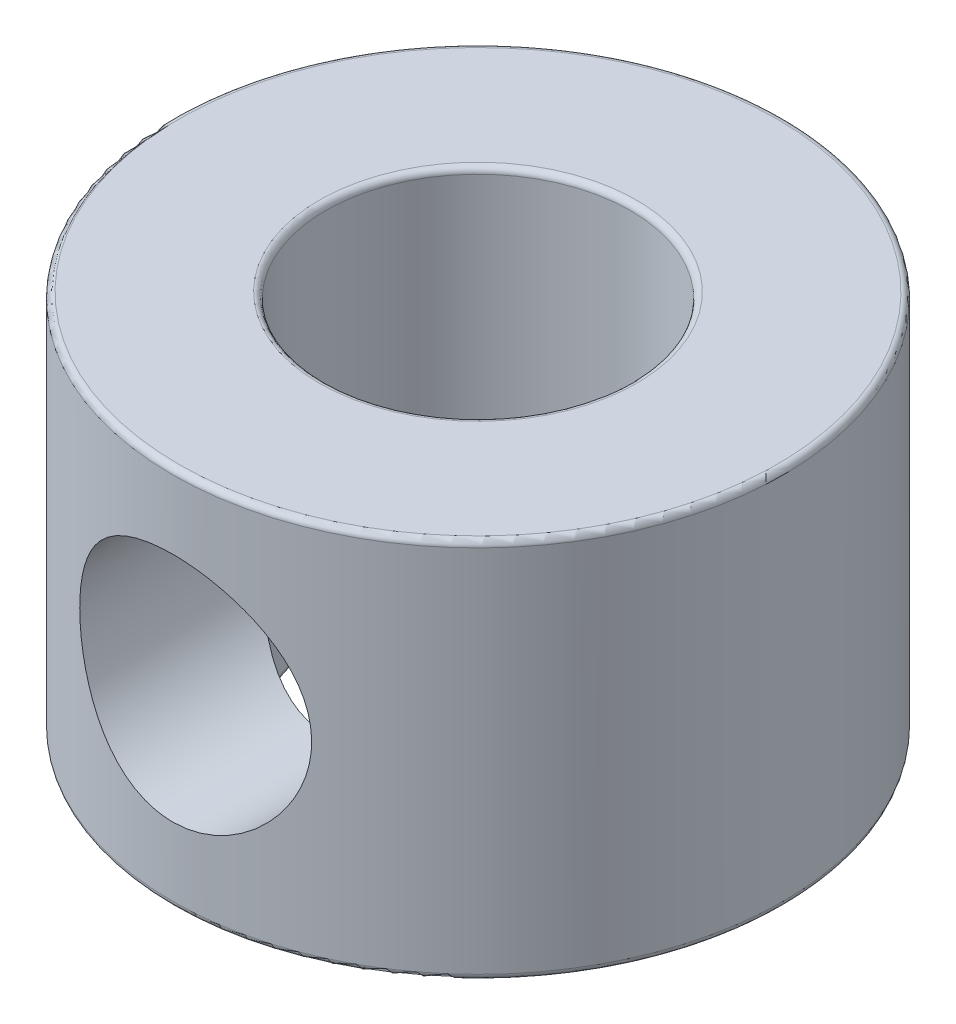
ISO-10303-21;
HEADER;
FILE_DESCRIPTION(('STEP AP214'),'2;1');
FILE_NAME('part.step','',(''),(''),'','','');
FILE_SCHEMA(('AUTOMOTIVE_DESIGN { 1 0 10303 214 1 1 1 1 }'));
ENDSEC;
DATA;
#1=APPLICATION_CONTEXT('core data for automotive mechanical design processes');
#2=APPLICATION_PROTOCOL_DEFINITION('international standard','automotive_design',2000,#1);
#3=PRODUCT_CONTEXT('',#1,'mechanical');
#4=PRODUCT('Part','Part','',(#3));
#5=PRODUCT_RELATED_PRODUCT_CATEGORY('part','',(#4));
#6=PRODUCT_DEFINITION_FORMATION('','',#4);
#7=PRODUCT_DEFINITION_CONTEXT('part definition',#1,'design');
#8=PRODUCT_DEFINITION('design','',#6,#7);
#9=PRODUCT_DEFINITION_SHAPE('','',#8);
#10=(LENGTH_UNIT() NAMED_UNIT(*) SI_UNIT(.MILLI.,.METRE.));
#11=(NAMED_UNIT(*) PLANE_ANGLE_UNIT() SI_UNIT($,.RADIAN.));
#12=(NAMED_UNIT(*) SI_UNIT($,.STERADIAN.) SOLID_ANGLE_UNIT());
#13=UNCERTAINTY_MEASURE_WITH_UNIT(LENGTH_MEASURE(1.E-05),#10,'distance_accuracy_value','');
#14=(GEOMETRIC_REPRESENTATION_CONTEXT(3) GLOBAL_UNCERTAINTY_ASSIGNED_CONTEXT((#13)) GLOBAL_UNIT_ASSIGNED_CONTEXT((#10,
#11,#12)) REPRESENTATION_CONTEXT('',''));
#15=CARTESIAN_POINT('',(0.,0.,0.));
#16=DIRECTION('',(0.,0.,1.));
#17=DIRECTION('',(1.,0.,0.));
#18=AXIS2_PLACEMENT_3D('',#15,#16,#17);
#19=CARTESIAN_POINT('',(0.,-3.96875,0.));
#20=DIRECTION('',(0.,1.,0.));
#21=DIRECTION('',(0.,0.,1.));
#22=AXIS2_PLACEMENT_3D('',#19,#20,#21);
#23=CYLINDRICAL_SURFACE('',#22,6.35);
#24=CARTESIAN_POINT('',(0.,-3.84175,0.));
#25=DIRECTION('',(0.,-1.,0.));
#26=DIRECTION('',(0.,0.,-1.));
#27=AXIS2_PLACEMENT_3D('',#24,#25,#26);
#28=CIRCLE('',#27,6.35);
#29=CARTESIAN_POINT('',(0.,-3.84175,-6.35));
#30=VERTEX_POINT('',#29);
#31=EDGE_CURVE('E61',#30,#30,#28,.F.);
#32=ORIENTED_EDGE('',*,*,#31,.T.);
#33=EDGE_LOOP('',(#32));
#34=FACE_BOUND('',#33,.T.);
#35=CARTESIAN_POINT('',(0.,3.84175,0.));
#36=DIRECTION('',(0.,1.,0.));
#37=DIRECTION('',(0.,0.,1.));
#38=AXIS2_PLACEMENT_3D('',#35,#36,#37);
#39=CIRCLE('',#38,6.35);
#40=CARTESIAN_POINT('',(0.,3.84175,6.35));
#41=VERTEX_POINT('',#40);
#42=EDGE_CURVE('E64',#41,#41,#39,.F.);
#43=ORIENTED_EDGE('',*,*,#42,.T.);
#44=EDGE_LOOP('',(#43));
#45=FACE_BOUND('',#44,.T.);
#46=CARTESIAN_POINT('',(0.,-2.41300000000002,6.35));
#47=CARTESIAN_POINT('',(0.130555931467963,-2.41300527534604,6.35000398969011));
#48=CARTESIAN_POINT('',(0.261076241377741,-2.40237145431133,6.34593890816647));
#49=CARTESIAN_POINT('',(0.518209446534916,-2.36029479676426,6.33012963929965));
#50=CARTESIAN_POINT('',(0.644823015088659,-2.3288555671578,6.31838678300935));
#51=CARTESIAN_POINT('',(0.890396734122707,-2.24644511602077,6.28848040494));
#52=CARTESIAN_POINT('',(1.00937135935964,-2.19551218938448,6.27032947705095));
#53=CARTESIAN_POINT('',(1.23707694907279,-2.07575764561936,6.22940932060408));
#54=CARTESIAN_POINT('',(1.34580507871093,-2.00693109764771,6.20663881943741));
#55=CARTESIAN_POINT('',(1.55465440906211,-1.85022277092615,6.15771932779737));
#56=CARTESIAN_POINT('',(1.65427192875036,-1.76170041624996,6.13147296383124));
#57=CARTESIAN_POINT('',(1.83765571561737,-1.56947315042907,6.07903240405007));
#58=CARTESIAN_POINT('',(1.9214169398814,-1.46576342765123,6.05283822744465));
#59=CARTESIAN_POINT('',(2.07395660623913,-1.24113386470125,6.00232668170518));
#60=CARTESIAN_POINT('',(2.14201618015846,-1.11969756154785,5.97812365120729));
#61=CARTESIAN_POINT('',(2.2565209385886,-0.866038380432364,5.93585432476053));
#62=CARTESIAN_POINT('',(2.30297502037547,-0.733819969020815,5.91778550353543));
#63=CARTESIAN_POINT('',(2.37094947712187,-0.46815363189804,5.89087364983882));
#64=CARTESIAN_POINT('',(2.39343294050414,-0.334989300795495,5.88167580744491));
#65=CARTESIAN_POINT('',(2.41583880524759,-0.0664845962936268,5.87251090464604));
#66=CARTESIAN_POINT('',(2.41577084821781,0.068854822423229,5.87253989940925));
#67=CARTESIAN_POINT('',(2.3938109010888,0.328972227003009,5.88152011871452));
#68=CARTESIAN_POINT('',(2.37326609797155,0.453886522563243,5.88992057372023));
#69=CARTESIAN_POINT('',(2.31316652422956,0.698339704990827,5.91378008823146));
#70=CARTESIAN_POINT('',(2.27360881167117,0.817877756841902,5.92924024008996));
#71=CARTESIAN_POINT('',(2.1758836409275,1.0508916152852,5.96580146890692));
#72=CARTESIAN_POINT('',(2.11737290423756,1.16420661484106,5.9870053159843));
#73=CARTESIAN_POINT('',(1.9836421741133,1.37979639920587,6.03263175509447));
#74=CARTESIAN_POINT('',(1.90841630395246,1.4820672822727,6.05705547794376));
#75=CARTESIAN_POINT('',(1.73726689770537,1.68010694238864,6.10842961274996));
#76=CARTESIAN_POINT('',(1.64027173491614,1.77493688260016,6.13543795015635));
#77=CARTESIAN_POINT('',(1.43144868882473,1.94726806056402,6.18748920351011));
#78=CARTESIAN_POINT('',(1.31961840653188,2.02476649017819,6.2125318005324));
#79=CARTESIAN_POINT('',(1.08185265975392,2.16130771487284,6.25835188225341));
#80=CARTESIAN_POINT('',(0.955717417234627,2.22002994310972,6.27905339803369));
#81=CARTESIAN_POINT('',(0.694375189035116,2.31510736575227,6.31329326294077));
#82=CARTESIAN_POINT('',(0.559172376611228,2.35147277236431,6.32683488218724));
#83=CARTESIAN_POINT('',(0.29142815021253,2.39898109857719,6.3446501972992));
#84=CARTESIAN_POINT('',(0.159141645079811,2.41138775289,6.34938771868047));
#85=CARTESIAN_POINT('',(-0.105693065348274,2.41431626348444,6.35049981057155));
#86=CARTESIAN_POINT('',(-0.238241203822051,2.40484312768027,6.34687629478166));
#87=CARTESIAN_POINT('',(-0.494323602805379,2.36523562382546,6.33197908606406));
#88=CARTESIAN_POINT('',(-0.618006844412112,2.33593589818826,6.32101461634214));
#89=CARTESIAN_POINT('',(-0.858609565436111,2.25861304376363,6.29285092848222));
#90=CARTESIAN_POINT('',(-0.975528163914418,2.21058748264174,6.27565090041604));
#91=CARTESIAN_POINT('',(-1.20317276582385,2.09563503714013,6.23607457125026));
#92=CARTESIAN_POINT('',(-1.3136121499673,2.02818967610492,6.21355984396609));
#93=CARTESIAN_POINT('',(-1.52197988578178,1.87689595883599,6.16583504517286));
#94=CARTESIAN_POINT('',(-1.61990351002367,1.79304143465585,6.14062396176678));
#95=CARTESIAN_POINT('',(-1.80656807112923,1.60543272496062,6.08841217199752));
#96=CARTESIAN_POINT('',(-1.89441393314818,1.50079040982171,6.06139435477813));
#97=CARTESIAN_POINT('',(-2.05148411432655,1.27772800811268,6.01005496187558));
#98=CARTESIAN_POINT('',(-2.12070651399854,1.15930650314626,5.98573366426972));
#99=CARTESIAN_POINT('',(-2.23870023772465,0.910922748538608,5.94261798623814));
#100=CARTESIAN_POINT('',(-2.2873646634247,0.780904332023385,5.92385264334907));
#101=CARTESIAN_POINT('',(-2.3617780094681,0.513602694331984,5.89458517077401));
#102=CARTESIAN_POINT('',(-2.38754162954714,0.37632419336358,5.8840777409413));
#103=CARTESIAN_POINT('',(-2.41408994040533,0.108127165215382,5.87323215610137));
#104=CARTESIAN_POINT('',(-2.41640623148609,-0.022615734384109,5.87227054588006));
#105=CARTESIAN_POINT('',(-2.39993732046552,-0.282524873396559,5.87902022534259));
#106=CARTESIAN_POINT('',(-2.38115423316034,-0.411691269511254,5.88673064582665));
#107=CARTESIAN_POINT('',(-2.32422421188574,-0.660552265849351,5.90943043237582));
#108=CARTESIAN_POINT('',(-2.28672002796393,-0.780417919491681,5.92417751295514));
#109=CARTESIAN_POINT('',(-2.19398528189401,-1.01222145618603,5.95914188552998));
#110=CARTESIAN_POINT('',(-2.13875018285589,-1.12415730124383,5.97936057736355));
#111=CARTESIAN_POINT('',(-2.00869997639506,-1.34342800575804,6.02433337271118));
#112=CARTESIAN_POINT('',(-1.93299650808673,-1.45019762417171,6.04927206356278));
#113=CARTESIAN_POINT('',(-1.76551836882647,-1.65000619367228,6.10025417003155));
#114=CARTESIAN_POINT('',(-1.67373852090439,-1.74304070389427,6.12629793945648));
#115=CARTESIAN_POINT('',(-1.47055494697207,-1.91807209951938,6.17831294001547));
#116=CARTESIAN_POINT('',(-1.35833856072123,-1.99915556641373,6.20419794006484));
#117=CARTESIAN_POINT('',(-1.12096041375389,-2.14129762074771,6.25144642675378));
#118=CARTESIAN_POINT('',(-0.995797050693137,-2.20235372565054,6.27280935273315));
#119=CARTESIAN_POINT('',(-0.728778395788021,-2.30499263616228,6.30955475572144));
#120=CARTESIAN_POINT('',(-0.586384697783378,-2.34532880523652,6.32454657619378));
#121=CARTESIAN_POINT('',(-0.295976705251582,-2.39932232882267,6.34476431329028));
#122=CARTESIAN_POINT('',(-0.147965475024479,-2.41299402119023,6.34999547828747));
#123=CARTESIAN_POINT('',(0.,-2.41300000000002,6.35));
#124=B_SPLINE_CURVE_WITH_KNOTS('',3,(#46,#47,#48,#49,#50,#51,#52,#53,#54,#55,#56,#57,#58,#59,
#60,#61,#62,#63,#64,#65,#66,#67,#68,#69,#70,#71,#72,#73,#74,#75,#76,#77,#78,#79,#80,#81,#82,#83,
#84,#85,#86,#87,#88,#89,#90,#91,#92,#93,#94,#95,#96,#97,#98,#99,#100,#101,#102,#103,#104,#105,
#106,#107,#108,#109,#110,#111,#112,#113,#114,#115,#116,#117,#118,#119,#120,#121,#122,#123),
.UNSPECIFIED.,.T.,.F.,(4,2,2,2,2,2,2,2,2,2,2,2,2,2,2,2,2,2,2,2,2,2,2,2,2,2,2,2,2,2,2,2,2,2,2,2,
2,2,4),(0.,0.391121887064187,0.78217598548619,1.17246577830223,1.56286323524964,1.9685463421271,
2.37435825594018,2.79613130529397,3.2177305117569,3.62166628723493,4.02542936468623,
4.40427313209374,4.78317553819669,5.16936515238196,5.55569075901498,5.96873424705116,
6.38184461005435,6.80167192308666,7.22130732355897,7.61812936188617,8.01486058335594,
8.3958515620237,8.77689204483071,9.16923685275006,9.56172942118019,9.97761353597016,
10.3935404987954,10.8116043631129,11.2293996833676,11.6197130905881,12.0099873800854,
12.3876994067833,12.7655081575184,13.1635000328782,13.5616203073396,13.9821012344606,
14.4026342635629,14.8461505355473,15.2894282569132),.UNSPECIFIED.);
#125=CARTESIAN_POINT('',(0.,-2.41300000000002,6.35));
#126=VERTEX_POINT('',#125);
#127=EDGE_CURVE('E75',#126,#126,#124,.T.);
#128=ORIENTED_EDGE('',*,*,#127,.F.);
#129=EDGE_LOOP('',(#128));
#130=FACE_BOUND('',#129,.T.);
#131=ADVANCED_FACE('F35',(#34,#45,#130),#23,.T.);
#132=CARTESIAN_POINT('',(6.35,-3.96875,0.));
#133=DIRECTION('',(0.,-1.,0.));
#134=DIRECTION('',(0.,0.,-1.));
#135=AXIS2_PLACEMENT_3D('',#132,#133,#134);
#136=PLANE('',#135);
#137=CARTESIAN_POINT('',(0.,-3.96875,0.));
#138=DIRECTION('',(0.,-1.,0.));
#139=DIRECTION('',(0.,0.,-1.));
#140=AXIS2_PLACEMENT_3D('',#137,#138,#139);
#141=CIRCLE('',#140,6.223);
#142=CARTESIAN_POINT('',(0.,-3.96875,-6.223));
#143=VERTEX_POINT('',#142);
#144=EDGE_CURVE('E55',#143,#143,#141,.T.);
#145=ORIENTED_EDGE('',*,*,#144,.T.);
#146=EDGE_LOOP('',(#145));
#147=FACE_BOUND('',#146,.T.);
#148=CARTESIAN_POINT('',(0.,-3.96875,0.));
#149=DIRECTION('',(0.,-1.,0.));
#150=DIRECTION('',(0.,0.,-1.));
#151=AXIS2_PLACEMENT_3D('',#148,#149,#150);
#152=CIRCLE('',#151,3.30200000000001);
#153=CARTESIAN_POINT('',(0.,-3.96875,-3.30200000000001));
#154=VERTEX_POINT('',#153);
#155=EDGE_CURVE('E58',#154,#154,#152,.F.);
#156=ORIENTED_EDGE('',*,*,#155,.T.);
#157=EDGE_LOOP('',(#156));
#158=FACE_BOUND('',#157,.T.);
#159=ADVANCED_FACE('F100',(#147,#158),#136,.T.);
#160=CARTESIAN_POINT('',(0.,3.96875,0.));
#161=DIRECTION('',(0.,1.,0.));
#162=DIRECTION('',(0.,0.,1.));
#163=AXIS2_PLACEMENT_3D('',#160,#161,#162);
#164=PLANE('',#163);
#165=CARTESIAN_POINT('',(0.,3.96875,0.));
#166=DIRECTION('',(0.,1.,0.));
#167=DIRECTION('',(0.,0.,1.));
#168=AXIS2_PLACEMENT_3D('',#165,#166,#167);
#169=CIRCLE('',#168,6.223);
#170=CARTESIAN_POINT('',(0.,3.96875,6.223));
#171=VERTEX_POINT('',#170);
#172=EDGE_CURVE('E46',#171,#171,#169,.T.);
#173=ORIENTED_EDGE('',*,*,#172,.T.);
#174=EDGE_LOOP('',(#173));
#175=FACE_BOUND('',#174,.T.);
#176=CARTESIAN_POINT('',(0.,3.96875,0.));
#177=DIRECTION('',(0.,1.,0.));
#178=DIRECTION('',(0.,0.,1.));
#179=AXIS2_PLACEMENT_3D('',#176,#177,#178);
#180=CIRCLE('',#179,3.30200000000001);
#181=CARTESIAN_POINT('',(0.,3.96875,3.30200000000001));
#182=VERTEX_POINT('',#181);
#183=EDGE_CURVE('E50',#182,#182,#180,.F.);
#184=ORIENTED_EDGE('',*,*,#183,.T.);
#185=EDGE_LOOP('',(#184));
#186=FACE_BOUND('',#185,.T.);
#187=ADVANCED_FACE('F96',(#175,#186),#164,.T.);
#188=CARTESIAN_POINT('',(0.,-3.96875,0.));
#189=DIRECTION('',(0.,-1.,0.));
#190=DIRECTION('',(0.,0.,-1.));
#191=AXIS2_PLACEMENT_3D('',#188,#189,#190);
#192=CYLINDRICAL_SURFACE('',#191,3.17500000000001);
#193=CARTESIAN_POINT('',(0.,3.84175,0.));
#194=DIRECTION('',(0.,1.,0.));
#195=DIRECTION('',(0.,0.,1.));
#196=AXIS2_PLACEMENT_3D('',#193,#194,#195);
#197=CIRCLE('',#196,3.17500000000001);
#198=CARTESIAN_POINT('',(0.,3.84175,3.17500000000001));
#199=VERTEX_POINT('',#198);
#200=EDGE_CURVE('E10',#199,#199,#197,.T.);
#201=ORIENTED_EDGE('',*,*,#200,.T.);
#202=EDGE_LOOP('',(#201));
#203=FACE_BOUND('',#202,.T.);
#204=CARTESIAN_POINT('',(0.,-3.84175,0.));
#205=DIRECTION('',(0.,-1.,0.));
#206=DIRECTION('',(0.,0.,-1.));
#207=AXIS2_PLACEMENT_3D('',#204,#205,#206);
#208=CIRCLE('',#207,3.17500000000001);
#209=CARTESIAN_POINT('',(0.,-3.84175,-3.17500000000001));
#210=VERTEX_POINT('',#209);
#211=EDGE_CURVE('E42',#210,#210,#208,.T.);
#212=ORIENTED_EDGE('',*,*,#211,.T.);
#213=EDGE_LOOP('',(#212));
#214=FACE_BOUND('',#213,.T.);
#215=CARTESIAN_POINT('',(-2.41300000000002,0.,2.06350575477753));
#216=CARTESIAN_POINT('',(-2.41300384876279,-0.0559977586078752,2.06349766555223));
#217=CARTESIAN_POINT('',(-2.41104636641708,-0.111969898434563,2.06579659278864));
#218=CARTESIAN_POINT('',(-2.40329389496794,-0.22329693231246,2.07481059221271));
#219=CARTESIAN_POINT('',(-2.39749800478208,-0.278651678324447,2.0815267013499));
#220=CARTESIAN_POINT('',(-2.37452643031284,-0.443230930902958,2.10779766430809));
#221=CARTESIAN_POINT('',(-2.35176778229741,-0.550742318211943,2.13347267357547));
#222=CARTESIAN_POINT('',(-2.2872235164681,-0.779883599892822,2.20269111734985));
#223=CARTESIAN_POINT('',(-2.24247550670672,-0.899832449342083,2.24883240950117));
#224=CARTESIAN_POINT('',(-2.13665555670059,-1.12834090979842,2.34961419483325));
#225=CARTESIAN_POINT('',(-2.07556237163151,-1.23688544035833,2.40426571035331));
#226=CARTESIAN_POINT('',(-1.93671110131201,-1.44489494143067,2.51753950718918));
#227=CARTESIAN_POINT('',(-1.8585910313599,-1.5440823699681,2.57622533251206));
#228=CARTESIAN_POINT('',(-1.68723666299454,-1.72965891554792,2.69156414414369));
#229=CARTESIAN_POINT('',(-1.59401525841437,-1.81605883145486,2.7482188147349));
#230=CARTESIAN_POINT('',(-1.39716607676684,-1.97117489136671,2.8531520885915));
#231=CARTESIAN_POINT('',(-1.2941428949445,-2.04048310408558,2.90168315757868));
#232=CARTESIAN_POINT('',(-1.07549217884956,-2.1636940617873,2.98960954011673));
#233=CARTESIAN_POINT('',(-0.959867289218932,-2.21760003057605,3.02900676512404));
#234=CARTESIAN_POINT('',(-0.778268848078236,-2.28497479285115,3.07878885025569));
#235=CARTESIAN_POINT('',(-0.716030885125078,-2.3052552639036,3.09388429687945));
#236=CARTESIAN_POINT('',(-0.589412014064374,-2.34082855423801,3.12047961644455));
#237=CARTESIAN_POINT('',(-0.525032304612983,-2.35612411330891,3.13198146434223));
#238=CARTESIAN_POINT('',(-0.394715052210577,-2.38142175097819,3.15105640174671));
#239=CARTESIAN_POINT('',(-0.328778746270046,-2.39142789428677,3.15863250794455));
#240=CARTESIAN_POINT('',(-0.195988271218935,-2.40595634867087,3.16964684540277));
#241=CARTESIAN_POINT('',(-0.129134271473167,-2.4104796582267,3.17308583007458));
#242=CARTESIAN_POINT('',(0.0511841549175368,-2.41510936582702,3.17660105133783));
#243=CARTESIAN_POINT('',(0.164928094451803,-2.41000230460154,3.17271037795876));
#244=CARTESIAN_POINT('',(0.389465719923919,-2.38404853994624,3.15304234409859));
#245=CARTESIAN_POINT('',(0.500259351245266,-2.36320154534608,3.13726476372363));
#246=CARTESIAN_POINT('',(0.712564981379433,-2.30791661997814,3.09583787288465));
#247=CARTESIAN_POINT('',(0.814259116450567,-2.27392555767624,3.07051376913961));
#248=CARTESIAN_POINT('',(1.01022655006777,-2.19390703299832,3.01173516184105));
#249=CARTESIAN_POINT('',(1.10449854806914,-2.14787746725433,2.97827923756767));
#250=CARTESIAN_POINT('',(1.29638558160431,-2.03855531905782,2.90036167852795));
#251=CARTESIAN_POINT('',(1.3928011033909,-1.97378646519788,2.85503040793758));
#252=CARTESIAN_POINT('',(1.57395461804204,-1.83260769966707,2.75931376891236));
#253=CARTESIAN_POINT('',(1.65867875852528,-1.75618420093983,2.70892252525814));
#254=CARTESIAN_POINT('',(1.83208498557193,-1.57629067194841,2.59555011449967));
#255=CARTESIAN_POINT('',(1.91804120273242,-1.47048459428231,2.53209961613442));
#256=CARTESIAN_POINT('',(2.07166543974387,-1.24475331537669,2.408015860265));
#257=CARTESIAN_POINT('',(2.1393368692998,-1.12483075254305,2.34738207925458));
#258=CARTESIAN_POINT('',(2.23852597032699,-0.906452830254806,2.25232386515265));
#259=CARTESIAN_POINT('',(2.27486341741356,-0.811329015962566,2.2153044738989));
#260=CARTESIAN_POINT('',(2.33575807059809,-0.614309687283791,2.15100626217277));
#261=CARTESIAN_POINT('',(2.36034336047522,-0.512430985661551,2.1237042606671));
#262=CARTESIAN_POINT('',(2.39332860368186,-0.320134141861214,2.0864164460846));
#263=CARTESIAN_POINT('',(2.40367817230442,-0.230463592181696,2.07436996737503));
#264=CARTESIAN_POINT('',(2.41418029529458,-0.0497431433859885,2.06214302897627));
#265=CARTESIAN_POINT('',(2.41434122945456,0.0413055605901437,2.06195281792722));
#266=CARTESIAN_POINT('',(2.4044766988836,0.221885933846368,2.07344242444912));
#267=CARTESIAN_POINT('',(2.39446905399604,0.311419978410849,2.08510147688318));
#268=CARTESIAN_POINT('',(2.36502018244625,0.487039971974255,2.11844014559028));
#269=CARTESIAN_POINT('',(2.34556334164157,0.573119957596308,2.14013634473028));
#270=CARTESIAN_POINT('',(2.28704796361356,0.77997695160089,2.2028649637028));
#271=CARTESIAN_POINT('',(2.24307446157913,0.898040009287477,2.24819256805863));
#272=CARTESIAN_POINT('',(2.13926887967051,1.12318316102985,2.34719282237522));
#273=CARTESIAN_POINT('',(2.07940154551665,1.23023809634993,2.40088391269594));
#274=CARTESIAN_POINT('',(1.94248178332445,1.4371109813778,2.51307238577684));
#275=CARTESIAN_POINT('',(1.86485638178862,1.53649151940846,2.57167523175722));
#276=CARTESIAN_POINT('',(1.69452086117819,1.72251287871632,2.68696847527322));
#277=CARTESIAN_POINT('',(1.60182266550316,1.80916366761607,2.74366034204564));
#278=CARTESIAN_POINT('',(1.40556091515509,1.96521630142342,2.84902792426831));
#279=CARTESIAN_POINT('',(1.30254084190406,2.03514653776939,2.89792571338473));
#280=CARTESIAN_POINT('',(1.08391773620377,2.15950380957091,2.98657218651875));
#281=CARTESIAN_POINT('',(0.968326619943828,2.21394535285109,3.02632942548937));
#282=CARTESIAN_POINT('',(0.74482079094914,2.29779200412863,3.0882412990162));
#283=CARTESIAN_POINT('',(0.638342844005653,2.32972356946183,3.11213912947555));
#284=CARTESIAN_POINT('',(0.420195997446281,2.37875511804171,3.14901056969518));
#285=CARTESIAN_POINT('',(0.308530427331927,2.39586447956237,3.16199108688334));
#286=CARTESIAN_POINT('',(0.0828219184165137,2.41424148805733,3.17593786628278));
#287=CARTESIAN_POINT('',(-0.0312267824469564,2.41546481782252,3.17687051856815));
#288=CARTESIAN_POINT('',(-0.257805395090498,2.40187224758132,3.16654814979772));
#289=CARTESIAN_POINT('',(-0.370335074323571,2.38705391933027,3.15529128360008));
#290=CARTESIAN_POINT('',(-0.58593905525384,2.34325647076855,3.12229262692282));
#291=CARTESIAN_POINT('',(-0.689211971147486,2.3148940072368,3.10100791737995));
#292=CARTESIAN_POINT('',(-0.889151757299798,2.2457028776014,3.04970488248077));
#293=CARTESIAN_POINT('',(-0.985817154713657,2.20487144312768,3.0196846177199));
#294=CARTESIAN_POINT('',(-1.18085626478236,2.10742739519713,2.94924603117488));
#295=CARTESIAN_POINT('',(-1.27834844786263,2.04960980335952,2.90806795459143));
#296=CARTESIAN_POINT('',(-1.46261071177135,1.92247011955614,2.81990227181933));
#297=CARTESIAN_POINT('',(-1.54937228529783,1.85313900030884,2.77291011448003));
#298=CARTESIAN_POINT('',(-1.72784395603139,1.68954564099504,2.66608820856437));
#299=CARTESIAN_POINT('',(-1.81710691394083,1.5930673351446,2.605563933213));
#300=CARTESIAN_POINT('',(-1.97904956164151,1.38677696208161,2.48478929538443));
#301=CARTESIAN_POINT('',(-2.05171850252802,1.27695632242084,2.42453913508871));
#302=CARTESIAN_POINT('',(-2.16807568831653,1.06487216980971,2.3205701398338));
#303=CARTESIAN_POINT('',(-2.21461451675718,0.964689378387316,2.27580945336279));
#304=CARTESIAN_POINT('',(-2.29431930368351,0.75571523840936,2.19543374929147));
#305=CARTESIAN_POINT('',(-2.32751489775822,0.646943616447746,2.15979852850724));
#306=CARTESIAN_POINT('',(-2.37259631613155,0.448484844074655,2.1100406465824));
#307=CARTESIAN_POINT('',(-2.38765491044805,0.360309685968913,2.09283199146418));
#308=CARTESIAN_POINT('',(-2.40784600754668,0.181397861765592,2.0695796751267));
#309=CARTESIAN_POINT('',(-2.41299376851077,0.0906653517186231,2.06351885195277));
#310=CARTESIAN_POINT('',(-2.41300000000002,0.,2.06350575477753));
#311=B_SPLINE_CURVE_WITH_KNOTS('',3,(#215,#216,#217,#218,#219,#220,#221,#222,#223,#224,#225,
#226,#227,#228,#229,#230,#231,#232,#233,#234,#235,#236,#237,#238,#239,#240,#241,#242,#243,#244,
#245,#246,#247,#248,#249,#250,#251,#252,#253,#254,#255,#256,#257,#258,#259,#260,#261,#262,#263,
#264,#265,#266,#267,#268,#269,#270,#271,#272,#273,#274,#275,#276,#277,#278,#279,#280,#281,#282,
#283,#284,#285,#286,#287,#288,#289,#290,#291,#292,#293,#294,#295,#296,#297,#298,#299,#300,#301,
#302,#303,#304,#305,#306,#307,#308,#309,#310),.UNSPECIFIED.,.T.,.F.,(4,2,2,2,2,2,2,2,2,2,2,2,2,
2,2,2,2,2,2,2,2,2,2,2,2,2,2,2,2,2,2,2,2,2,2,2,2,2,2,2,2,2,2,2,2,2,2,4),(0.,0.167865888256096,
0.335771197712655,0.672253113083612,1.07835156891592,1.484980441824,1.90128606810367,
2.31723809952882,2.71564984217271,3.11397813304136,3.31524451605406,3.51640009249263,
3.71740086315177,3.91836502400481,4.25822516390756,4.59809159097933,4.9272962770108,
5.25655852017199,5.62925585145854,6.00239104485092,6.45173609342001,6.9009972912419,
7.22505308842911,7.54833057917694,7.82029622288306,8.0920381815341,8.36330474814154,
8.63502109706672,9.03448223102895,9.43483692618397,9.85060800682654,10.2660517758865,
10.6657843340456,11.0651412318547,11.4047809397803,11.744205594297,12.0845769378617,
12.4249998110424,12.7512185535045,13.0775097760132,13.4379766338631,13.7987274649636,
14.2312195288267,14.663990953106,15.0204698871451,15.3761526405412,15.648361858629,
15.920151661983),.UNSPECIFIED.);
#312=CARTESIAN_POINT('',(-2.41300000000002,0.,2.06350575477753));
#313=VERTEX_POINT('',#312);
#314=EDGE_CURVE('E67',#313,#313,#311,.T.);
#315=ORIENTED_EDGE('',*,*,#314,.T.);
#316=EDGE_LOOP('',(#315));
#317=FACE_BOUND('',#316,.T.);
#318=ADVANCED_FACE('F80',(#203,#214,#317),#192,.F.);
#319=CARTESIAN_POINT('',(0.,0.,2.06350575477753));
#320=DIRECTION('',(0.,0.,-1.));
#321=DIRECTION('',(-1.,0.,0.));
#322=AXIS2_PLACEMENT_3D('',#319,#320,#321);
#323=CYLINDRICAL_SURFACE('',#322,2.41300000000002);
#324=ORIENTED_EDGE('',*,*,#127,.T.);
#325=EDGE_LOOP('',(#324));
#326=FACE_BOUND('',#325,.T.);
#327=ORIENTED_EDGE('',*,*,#314,.F.);
#328=EDGE_LOOP('',(#327));
#329=FACE_BOUND('',#328,.T.);
#330=ADVANCED_FACE('F83',(#326,#329),#323,.F.);
#331=CARTESIAN_POINT('',(0.,-3.84175,0.));
#332=DIRECTION('',(0.,-1.,0.));
#333=DIRECTION('',(0.,0.,-1.));
#334=AXIS2_PLACEMENT_3D('',#331,#332,#333);
#335=TOROIDAL_SURFACE('',#334,6.223,0.127);
#336=ORIENTED_EDGE('',*,*,#144,.F.);
#337=EDGE_LOOP('',(#336));
#338=FACE_BOUND('',#337,.T.);
#339=ORIENTED_EDGE('',*,*,#31,.F.);
#340=EDGE_LOOP('',(#339));
#341=FACE_BOUND('',#340,.T.);
#342=ADVANCED_FACE('F86',(#338,#341),#335,.T.);
#343=CARTESIAN_POINT('',(0.,3.84175,0.));
#344=DIRECTION('',(0.,1.,0.));
#345=DIRECTION('',(0.,0.,1.));
#346=AXIS2_PLACEMENT_3D('',#343,#344,#345);
#347=TOROIDAL_SURFACE('',#346,6.223,0.127);
#348=ORIENTED_EDGE('',*,*,#42,.F.);
#349=EDGE_LOOP('',(#348));
#350=FACE_BOUND('',#349,.T.);
#351=ORIENTED_EDGE('',*,*,#172,.F.);
#352=EDGE_LOOP('',(#351));
#353=FACE_BOUND('',#352,.T.);
#354=ADVANCED_FACE('F93',(#350,#353),#347,.T.);
#355=CARTESIAN_POINT('',(0.,3.84175,0.));
#356=DIRECTION('',(0.,1.,0.));
#357=DIRECTION('',(0.,0.,1.));
#358=AXIS2_PLACEMENT_3D('',#355,#356,#357);
#359=TOROIDAL_SURFACE('',#358,3.30200000000001,0.127);
#360=ORIENTED_EDGE('',*,*,#200,.F.);
#361=EDGE_LOOP('',(#360));
#362=FACE_BOUND('',#361,.T.);
#363=ORIENTED_EDGE('',*,*,#183,.F.);
#364=EDGE_LOOP('',(#363));
#365=FACE_BOUND('',#364,.T.);
#366=ADVANCED_FACE('F111',(#362,#365),#359,.T.);
#367=CARTESIAN_POINT('',(0.,-3.84175,0.));
#368=DIRECTION('',(0.,-1.,0.));
#369=DIRECTION('',(0.,0.,-1.));
#370=AXIS2_PLACEMENT_3D('',#367,#368,#369);
#371=TOROIDAL_SURFACE('',#370,3.30200000000001,0.127);
#372=ORIENTED_EDGE('',*,*,#155,.F.);
#373=EDGE_LOOP('',(#372));
#374=FACE_BOUND('',#373,.T.);
#375=ORIENTED_EDGE('',*,*,#211,.F.);
#376=EDGE_LOOP('',(#375));
#377=FACE_BOUND('',#376,.T.);
#378=ADVANCED_FACE('F37',(#374,#377),#371,.T.);
#379=CLOSED_SHELL('',(#131,#159,#187,#318,#330,#342,#354,#366,#378));
#380=MANIFOLD_SOLID_BREP('B2',#379);
#381=ADVANCED_BREP_SHAPE_REPRESENTATION('',(#18,#380),#14);
#382=SHAPE_DEFINITION_REPRESENTATION(#9,#381);
ENDSEC;
END-ISO-10303-21;
